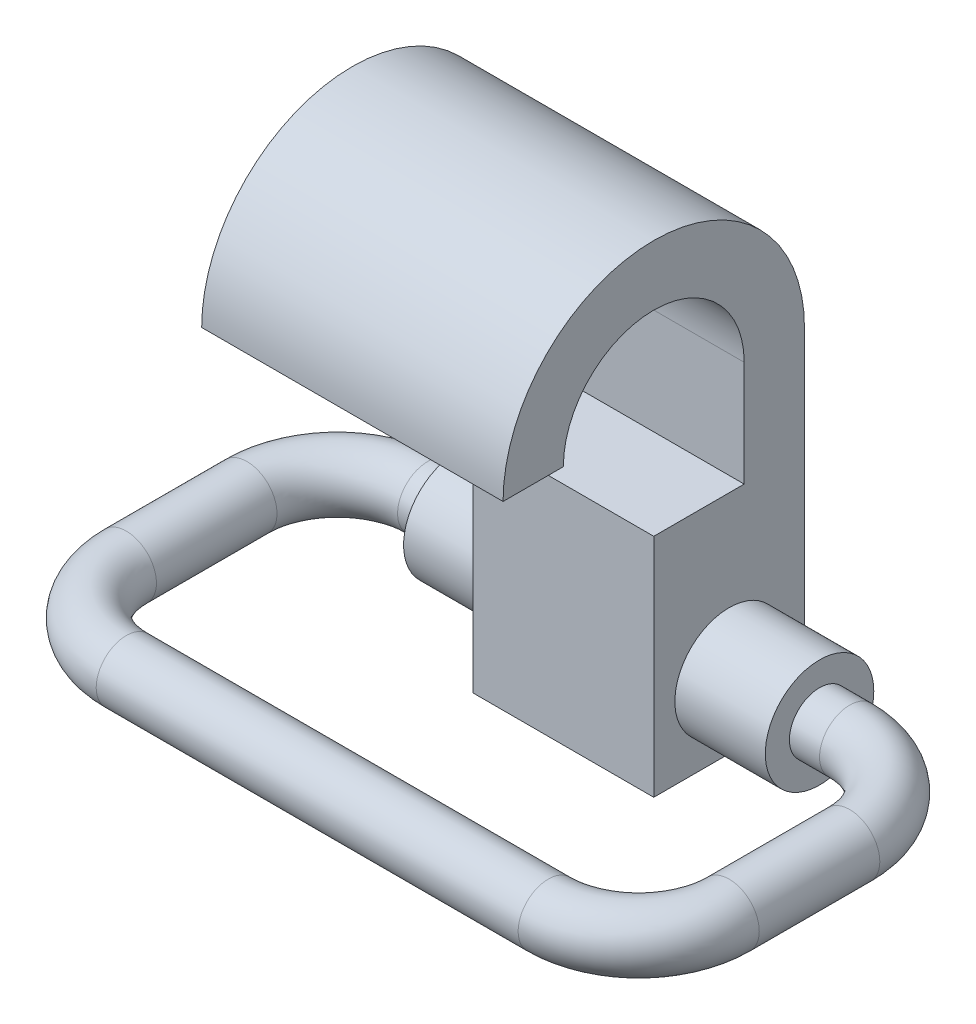
ISO-10303-21;
HEADER;
FILE_DESCRIPTION(('STEP AP214'),'2;1');
FILE_NAME('part.step','',(''),(''),'','','');
FILE_SCHEMA(('AUTOMOTIVE_DESIGN { 1 0 10303 214 1 1 1 1 }'));
ENDSEC;
DATA;
#1=APPLICATION_CONTEXT('core data for automotive mechanical design processes');
#2=APPLICATION_PROTOCOL_DEFINITION('international standard','automotive_design',2000,#1);
#3=PRODUCT_CONTEXT('',#1,'mechanical');
#4=PRODUCT('Part','Part','',(#3));
#5=PRODUCT_RELATED_PRODUCT_CATEGORY('part','',(#4));
#6=PRODUCT_DEFINITION_FORMATION('','',#4);
#7=PRODUCT_DEFINITION_CONTEXT('part definition',#1,'design');
#8=PRODUCT_DEFINITION('design','',#6,#7);
#9=PRODUCT_DEFINITION_SHAPE('','',#8);
#10=(LENGTH_UNIT() NAMED_UNIT(*) SI_UNIT(.MILLI.,.METRE.));
#11=(NAMED_UNIT(*) PLANE_ANGLE_UNIT() SI_UNIT($,.RADIAN.));
#12=(NAMED_UNIT(*) SI_UNIT($,.STERADIAN.) SOLID_ANGLE_UNIT());
#13=UNCERTAINTY_MEASURE_WITH_UNIT(LENGTH_MEASURE(1.E-05),#10,'distance_accuracy_value','');
#14=(GEOMETRIC_REPRESENTATION_CONTEXT(3) GLOBAL_UNCERTAINTY_ASSIGNED_CONTEXT((#13)) GLOBAL_UNIT_ASSIGNED_CONTEXT((#10,
#11,#12)) REPRESENTATION_CONTEXT('',''));
#15=CARTESIAN_POINT('',(0.,0.,0.));
#16=DIRECTION('',(0.,0.,1.));
#17=DIRECTION('',(1.,0.,0.));
#18=AXIS2_PLACEMENT_3D('',#15,#16,#17);
#19=CARTESIAN_POINT('',(-300.,725.,250.));
#20=DIRECTION('',(-1.,0.,0.));
#21=DIRECTION('',(0.,0.,-1.));
#22=AXIS2_PLACEMENT_3D('',#19,#20,#21);
#23=PLANE('',#22);
#24=CARTESIAN_POINT('',(-300.,-135.,0.));
#25=DIRECTION('',(1.,0.,0.));
#26=DIRECTION('',(0.,0.,-1.));
#27=AXIS2_PLACEMENT_3D('',#24,#25,#26);
#28=CIRCLE('',#27,180.);
#29=CARTESIAN_POINT('',(-300.,-135.,-180.));
#30=VERTEX_POINT('',#29);
#31=EDGE_CURVE('E41',#30,#30,#28,.F.);
#32=ORIENTED_EDGE('',*,*,#31,.F.);
#33=EDGE_LOOP('',(#32));
#34=FACE_BOUND('',#33,.T.);
#35=DIRECTION('',(0.,1.,0.));
#36=VECTOR('',#35,1.);
#37=CARTESIAN_POINT('',(-300.,724.999999999997,-50.));
#38=LINE('',#37,#36);
#39=CARTESIAN_POINT('',(-300.,375.,-50.));
#40=VERTEX_POINT('',#39);
#41=CARTESIAN_POINT('',(-300.,724.999999999997,-50.));
#42=VERTEX_POINT('',#41);
#43=EDGE_CURVE('E136',#40,#42,#38,.T.);
#44=ORIENTED_EDGE('',*,*,#43,.T.);
#45=DIRECTION('',(0.,0.,1.));
#46=VECTOR('',#45,1.);
#47=CARTESIAN_POINT('',(-300.,724.999999999997,-250.));
#48=LINE('',#47,#46);
#49=CARTESIAN_POINT('',(-300.,724.999999999997,-250.));
#50=VERTEX_POINT('',#49);
#51=EDGE_CURVE('E129',#50,#42,#48,.T.);
#52=ORIENTED_EDGE('',*,*,#51,.F.);
#53=DIRECTION('',(0.,-1.,0.));
#54=VECTOR('',#53,1.);
#55=CARTESIAN_POINT('',(-300.,375.,-250.));
#56=LINE('',#55,#54);
#57=CARTESIAN_POINT('',(-300.,-375.,-250.));
#58=VERTEX_POINT('',#57);
#59=EDGE_CURVE('E149',#50,#58,#56,.T.);
#60=ORIENTED_EDGE('',*,*,#59,.T.);
#61=DIRECTION('',(0.,0.,1.));
#62=VECTOR('',#61,1.);
#63=CARTESIAN_POINT('',(-300.,-375.,250.));
#64=LINE('',#63,#62);
#65=CARTESIAN_POINT('',(-300.,-375.,250.));
#66=VERTEX_POINT('',#65);
#67=EDGE_CURVE('E152',#58,#66,#64,.T.);
#68=ORIENTED_EDGE('',*,*,#67,.T.);
#69=DIRECTION('',(0.,1.,0.));
#70=VECTOR('',#69,1.);
#71=CARTESIAN_POINT('',(-300.,375.,250.));
#72=LINE('',#71,#70);
#73=CARTESIAN_POINT('',(-300.,375.,250.));
#74=VERTEX_POINT('',#73);
#75=EDGE_CURVE('E139',#66,#74,#72,.T.);
#76=ORIENTED_EDGE('',*,*,#75,.T.);
#77=DIRECTION('',(0.,0.,-1.));
#78=VECTOR('',#77,1.);
#79=CARTESIAN_POINT('',(-300.,375.,250.));
#80=LINE('',#79,#78);
#81=EDGE_CURVE('E146',#74,#40,#80,.T.);
#82=ORIENTED_EDGE('',*,*,#81,.T.);
#83=EDGE_LOOP('',(#44,#52,#60,#68,#76,#82));
#84=FACE_BOUND('',#83,.T.);
#85=ADVANCED_FACE('F37',(#34,#84),#23,.T.);
#86=CARTESIAN_POINT('',(300.,375.,0.));
#87=DIRECTION('',(0.,1.,0.));
#88=DIRECTION('',(0.,0.,1.));
#89=AXIS2_PLACEMENT_3D('',#86,#87,#88);
#90=PLANE('',#89);
#91=DIRECTION('',(1.,0.,0.));
#92=VECTOR('',#91,1.);
#93=CARTESIAN_POINT('',(0.,375.,-50.));
#94=LINE('',#93,#92);
#95=CARTESIAN_POINT('',(300.,375.,-50.));
#96=VERTEX_POINT('',#95);
#97=EDGE_CURVE('E192',#40,#96,#94,.T.);
#98=ORIENTED_EDGE('',*,*,#97,.F.);
#99=ORIENTED_EDGE('',*,*,#81,.F.);
#100=DIRECTION('',(-1.,0.,0.));
#101=VECTOR('',#100,1.);
#102=CARTESIAN_POINT('',(300.,375.,250.));
#103=LINE('',#102,#101);
#104=CARTESIAN_POINT('',(300.,375.,250.));
#105=VERTEX_POINT('',#104);
#106=EDGE_CURVE('E229',#105,#74,#103,.T.);
#107=ORIENTED_EDGE('',*,*,#106,.F.);
#108=DIRECTION('',(0.,0.,-1.));
#109=VECTOR('',#108,1.);
#110=CARTESIAN_POINT('',(300.,375.,0.));
#111=LINE('',#110,#109);
#112=EDGE_CURVE('E206',#105,#96,#111,.T.);
#113=ORIENTED_EDGE('',*,*,#112,.T.);
#114=EDGE_LOOP('',(#98,#99,#107,#113));
#115=FACE_BOUND('',#114,.T.);
#116=ADVANCED_FACE('F250',(#115),#90,.T.);
#117=CARTESIAN_POINT('',(-600.,-135.,0.));
#118=DIRECTION('',(1.,0.,0.));
#119=DIRECTION('',(0.,0.,-1.));
#120=AXIS2_PLACEMENT_3D('',#117,#118,#119);
#121=CYLINDRICAL_SURFACE('',#120,180.);
#122=CARTESIAN_POINT('',(-600.,-135.,0.));
#123=DIRECTION('',(1.,0.,0.));
#124=DIRECTION('',(0.,0.,-1.));
#125=AXIS2_PLACEMENT_3D('',#122,#123,#124);
#126=CIRCLE('',#125,180.);
#127=CARTESIAN_POINT('',(-600.,-135.,-180.));
#128=VERTEX_POINT('',#127);
#129=EDGE_CURVE('E155',#128,#128,#126,.T.);
#130=ORIENTED_EDGE('',*,*,#129,.T.);
#131=EDGE_LOOP('',(#130));
#132=FACE_BOUND('',#131,.T.);
#133=ORIENTED_EDGE('',*,*,#31,.T.);
#134=EDGE_LOOP('',(#133));
#135=FACE_BOUND('',#134,.T.);
#136=ADVANCED_FACE('F243',(#132,#135),#121,.T.);
#137=CARTESIAN_POINT('',(700.,-135.,0.));
#138=DIRECTION('',(-1.,0.,0.));
#139=DIRECTION('',(0.,0.,1.));
#140=AXIS2_PLACEMENT_3D('',#137,#138,#139);
#141=CYLINDRICAL_SURFACE('',#140,100.);
#142=CARTESIAN_POINT('',(600.,-135.,0.));
#143=DIRECTION('',(1.,0.,0.));
#144=DIRECTION('',(0.,0.,-1.));
#145=AXIS2_PLACEMENT_3D('',#142,#143,#144);
#146=CIRCLE('',#145,100.);
#147=CARTESIAN_POINT('',(600.,-135.,-100.));
#148=VERTEX_POINT('',#147);
#149=EDGE_CURVE('E231',#148,#148,#146,.T.);
#150=ORIENTED_EDGE('',*,*,#149,.T.);
#151=EDGE_LOOP('',(#150));
#152=FACE_BOUND('',#151,.T.);
#153=CARTESIAN_POINT('',(700.,-135.,0.));
#154=DIRECTION('',(1.,0.,0.));
#155=DIRECTION('',(0.,0.,-1.));
#156=AXIS2_PLACEMENT_3D('',#153,#154,#155);
#157=CIRCLE('',#156,100.);
#158=CARTESIAN_POINT('',(700.,-135.,-99.9999999999999));
#159=VERTEX_POINT('',#158);
#160=EDGE_CURVE('E46',#159,#159,#157,.T.);
#161=ORIENTED_EDGE('',*,*,#160,.F.);
#162=EDGE_LOOP('',(#161));
#163=FACE_BOUND('',#162,.T.);
#164=ADVANCED_FACE('F39',(#152,#163),#141,.T.);
#165=CARTESIAN_POINT('',(600.,-135.,0.));
#166=DIRECTION('',(-1.,0.,0.));
#167=DIRECTION('',(0.,0.,1.));
#168=AXIS2_PLACEMENT_3D('',#165,#166,#167);
#169=CYLINDRICAL_SURFACE('',#168,180.);
#170=CARTESIAN_POINT('',(300.,-135.,0.));
#171=DIRECTION('',(1.,0.,0.));
#172=DIRECTION('',(0.,0.,-1.));
#173=AXIS2_PLACEMENT_3D('',#170,#171,#172);
#174=CIRCLE('',#173,180.);
#175=CARTESIAN_POINT('',(300.,-135.,-180.));
#176=VERTEX_POINT('',#175);
#177=EDGE_CURVE('E200',#176,#176,#174,.T.);
#178=ORIENTED_EDGE('',*,*,#177,.T.);
#179=EDGE_LOOP('',(#178));
#180=FACE_BOUND('',#179,.T.);
#181=CARTESIAN_POINT('',(600.,-135.,0.));
#182=DIRECTION('',(1.,0.,0.));
#183=DIRECTION('',(0.,0.,-1.));
#184=AXIS2_PLACEMENT_3D('',#181,#182,#183);
#185=CIRCLE('',#184,180.);
#186=CARTESIAN_POINT('',(600.,-135.,-180.));
#187=VERTEX_POINT('',#186);
#188=EDGE_CURVE('E234',#187,#187,#185,.T.);
#189=ORIENTED_EDGE('',*,*,#188,.F.);
#190=EDGE_LOOP('',(#189));
#191=FACE_BOUND('',#190,.T.);
#192=ADVANCED_FACE('F242',(#180,#191),#169,.T.);
#193=CARTESIAN_POINT('',(600.,0.,0.));
#194=DIRECTION('',(1.,0.,0.));
#195=DIRECTION('',(0.,0.,-1.));
#196=AXIS2_PLACEMENT_3D('',#193,#194,#195);
#197=PLANE('',#196);
#198=ORIENTED_EDGE('',*,*,#149,.F.);
#199=EDGE_LOOP('',(#198));
#200=FACE_BOUND('',#199,.T.);
#201=ORIENTED_EDGE('',*,*,#188,.T.);
#202=EDGE_LOOP('',(#201));
#203=FACE_BOUND('',#202,.T.);
#204=ADVANCED_FACE('F249',(#200,#203),#197,.T.);
#205=CARTESIAN_POINT('',(300.,0.,250.));
#206=DIRECTION('',(0.,0.,1.));
#207=DIRECTION('',(0.,-1.,0.));
#208=AXIS2_PLACEMENT_3D('',#205,#206,#207);
#209=PLANE('',#208);
#210=ORIENTED_EDGE('',*,*,#106,.T.);
#211=ORIENTED_EDGE('',*,*,#75,.F.);
#212=DIRECTION('',(-1.,0.,0.));
#213=VECTOR('',#212,1.);
#214=CARTESIAN_POINT('',(300.,-375.,250.));
#215=LINE('',#214,#213);
#216=CARTESIAN_POINT('',(300.,-375.,250.));
#217=VERTEX_POINT('',#216);
#218=EDGE_CURVE('E61',#217,#66,#215,.T.);
#219=ORIENTED_EDGE('',*,*,#218,.F.);
#220=DIRECTION('',(0.,1.,0.));
#221=VECTOR('',#220,1.);
#222=CARTESIAN_POINT('',(300.,0.,250.));
#223=LINE('',#222,#221);
#224=EDGE_CURVE('E217',#217,#105,#223,.T.);
#225=ORIENTED_EDGE('',*,*,#224,.T.);
#226=EDGE_LOOP('',(#210,#211,#219,#225));
#227=FACE_BOUND('',#226,.T.);
#228=ADVANCED_FACE('F324',(#227),#209,.T.);
#229=CARTESIAN_POINT('',(300.,-375.,0.));
#230=DIRECTION('',(0.,1.,0.));
#231=DIRECTION('',(0.,0.,1.));
#232=AXIS2_PLACEMENT_3D('',#229,#230,#231);
#233=PLANE('',#232);
#234=ORIENTED_EDGE('',*,*,#218,.T.);
#235=ORIENTED_EDGE('',*,*,#67,.F.);
#236=DIRECTION('',(-1.,0.,0.));
#237=VECTOR('',#236,1.);
#238=CARTESIAN_POINT('',(300.,-375.,-250.));
#239=LINE('',#238,#237);
#240=CARTESIAN_POINT('',(300.,-375.,-250.));
#241=VERTEX_POINT('',#240);
#242=EDGE_CURVE('E226',#241,#58,#239,.T.);
#243=ORIENTED_EDGE('',*,*,#242,.F.);
#244=DIRECTION('',(0.,0.,-1.));
#245=VECTOR('',#244,1.);
#246=CARTESIAN_POINT('',(300.,-375.,0.));
#247=LINE('',#246,#245);
#248=EDGE_CURVE('E219',#217,#241,#247,.T.);
#249=ORIENTED_EDGE('',*,*,#248,.F.);
#250=EDGE_LOOP('',(#234,#235,#243,#249));
#251=FACE_BOUND('',#250,.T.);
#252=ADVANCED_FACE('F321',(#251),#233,.F.);
#253=CARTESIAN_POINT('',(300.,0.,-250.));
#254=DIRECTION('',(0.,0.,1.));
#255=DIRECTION('',(0.,-1.,0.));
#256=AXIS2_PLACEMENT_3D('',#253,#254,#255);
#257=PLANE('',#256);
#258=ORIENTED_EDGE('',*,*,#242,.T.);
#259=ORIENTED_EDGE('',*,*,#59,.F.);
#260=DIRECTION('',(-1.,0.,0.));
#261=VECTOR('',#260,1.);
#262=CARTESIAN_POINT('',(0.,725.,-250.));
#263=LINE('',#262,#261);
#264=CARTESIAN_POINT('',(300.,725.,-250.));
#265=VERTEX_POINT('',#264);
#266=EDGE_CURVE('E134',#265,#50,#263,.T.);
#267=ORIENTED_EDGE('',*,*,#266,.F.);
#268=DIRECTION('',(0.,1.,0.));
#269=VECTOR('',#268,1.);
#270=CARTESIAN_POINT('',(300.,0.,-250.));
#271=LINE('',#270,#269);
#272=EDGE_CURVE('E53',#241,#265,#271,.T.);
#273=ORIENTED_EDGE('',*,*,#272,.F.);
#274=EDGE_LOOP('',(#258,#259,#267,#273));
#275=FACE_BOUND('',#274,.T.);
#276=ADVANCED_FACE('F317',(#275),#257,.F.);
#277=CARTESIAN_POINT('',(300.,0.,0.));
#278=DIRECTION('',(1.,0.,0.));
#279=DIRECTION('',(0.,0.,-1.));
#280=AXIS2_PLACEMENT_3D('',#277,#278,#279);
#281=PLANE('',#280);
#282=ORIENTED_EDGE('',*,*,#177,.F.);
#283=EDGE_LOOP('',(#282));
#284=FACE_BOUND('',#283,.T.);
#285=ORIENTED_EDGE('',*,*,#112,.F.);
#286=ORIENTED_EDGE('',*,*,#224,.F.);
#287=ORIENTED_EDGE('',*,*,#248,.T.);
#288=ORIENTED_EDGE('',*,*,#272,.T.);
#289=CARTESIAN_POINT('',(300.,725.,250.));
#290=DIRECTION('',(1.,0.,0.));
#291=DIRECTION('',(0.,0.,-1.));
#292=AXIS2_PLACEMENT_3D('',#289,#290,#291);
#293=CIRCLE('',#292,500.);
#294=CARTESIAN_POINT('',(300.,725.,750.));
#295=VERTEX_POINT('',#294);
#296=EDGE_CURVE('E185',#265,#295,#293,.T.);
#297=ORIENTED_EDGE('',*,*,#296,.T.);
#298=DIRECTION('',(0.,0.,-1.));
#299=VECTOR('',#298,1.);
#300=CARTESIAN_POINT('',(300.,725.,750.));
#301=LINE('',#300,#299);
#302=CARTESIAN_POINT('',(300.,725.,550.));
#303=VERTEX_POINT('',#302);
#304=EDGE_CURVE('E182',#295,#303,#301,.T.);
#305=ORIENTED_EDGE('',*,*,#304,.T.);
#306=CARTESIAN_POINT('',(300.,725.,250.));
#307=DIRECTION('',(1.,0.,0.));
#308=DIRECTION('',(0.,0.,-1.));
#309=AXIS2_PLACEMENT_3D('',#306,#307,#308);
#310=CIRCLE('',#309,300.);
#311=CARTESIAN_POINT('',(300.,725.,-50.));
#312=VERTEX_POINT('',#311);
#313=EDGE_CURVE('E179',#312,#303,#310,.T.);
#314=ORIENTED_EDGE('',*,*,#313,.F.);
#315=DIRECTION('',(0.,-1.,0.));
#316=VECTOR('',#315,1.);
#317=CARTESIAN_POINT('',(300.,725.,-50.));
#318=LINE('',#317,#316);
#319=EDGE_CURVE('E197',#312,#96,#318,.T.);
#320=ORIENTED_EDGE('',*,*,#319,.T.);
#321=EDGE_LOOP('',(#285,#286,#287,#288,#297,#305,#314,#320));
#322=FACE_BOUND('',#321,.T.);
#323=ADVANCED_FACE('F313',(#284,#322),#281,.T.);
#324=CARTESIAN_POINT('',(0.,725.,-50.));
#325=DIRECTION('',(0.,0.,-1.));
#326=DIRECTION('',(-1.,0.,0.));
#327=AXIS2_PLACEMENT_3D('',#324,#325,#326);
#328=PLANE('',#327);
#329=ORIENTED_EDGE('',*,*,#97,.T.);
#330=ORIENTED_EDGE('',*,*,#319,.F.);
#331=DIRECTION('',(1.,0.,0.));
#332=VECTOR('',#331,1.);
#333=CARTESIAN_POINT('',(0.,725.,-50.));
#334=LINE('',#333,#332);
#335=EDGE_CURVE('E194',#42,#312,#334,.T.);
#336=ORIENTED_EDGE('',*,*,#335,.F.);
#337=ORIENTED_EDGE('',*,*,#43,.F.);
#338=EDGE_LOOP('',(#329,#330,#336,#337));
#339=FACE_BOUND('',#338,.T.);
#340=ADVANCED_FACE('F309',(#339),#328,.F.);
#341=CARTESIAN_POINT('',(0.,725.,250.));
#342=DIRECTION('',(1.,0.,0.));
#343=DIRECTION('',(0.,0.,-1.));
#344=AXIS2_PLACEMENT_3D('',#341,#342,#343);
#345=CYLINDRICAL_SURFACE('',#344,300.);
#346=ORIENTED_EDGE('',*,*,#313,.T.);
#347=DIRECTION('',(1.,0.,0.));
#348=VECTOR('',#347,1.);
#349=CARTESIAN_POINT('',(0.,725.,550.));
#350=LINE('',#349,#348);
#351=CARTESIAN_POINT('',(-700.,725.,550.));
#352=VERTEX_POINT('',#351);
#353=EDGE_CURVE('E190',#352,#303,#350,.T.);
#354=ORIENTED_EDGE('',*,*,#353,.F.);
#355=CARTESIAN_POINT('',(-700.,725.,250.));
#356=DIRECTION('',(1.,0.,0.));
#357=DIRECTION('',(0.,0.,1.));
#358=AXIS2_PLACEMENT_3D('',#355,#356,#357);
#359=CIRCLE('',#358,300.);
#360=CARTESIAN_POINT('',(-700.,724.999999999997,-50.));
#361=VERTEX_POINT('',#360);
#362=EDGE_CURVE('E120',#361,#352,#359,.T.);
#363=ORIENTED_EDGE('',*,*,#362,.F.);
#364=DIRECTION('',(1.,0.,0.));
#365=VECTOR('',#364,1.);
#366=CARTESIAN_POINT('',(-700.,724.999999999997,-50.));
#367=LINE('',#366,#365);
#368=EDGE_CURVE('E116',#361,#42,#367,.T.);
#369=ORIENTED_EDGE('',*,*,#368,.T.);
#370=ORIENTED_EDGE('',*,*,#335,.T.);
#371=EDGE_LOOP('',(#346,#354,#363,#369,#370));
#372=FACE_BOUND('',#371,.T.);
#373=ADVANCED_FACE('F305',(#372),#345,.F.);
#374=CARTESIAN_POINT('',(0.,725.,750.));
#375=DIRECTION('',(0.,-1.,0.));
#376=DIRECTION('',(0.,0.,-1.));
#377=AXIS2_PLACEMENT_3D('',#374,#375,#376);
#378=PLANE('',#377);
#379=ORIENTED_EDGE('',*,*,#304,.F.);
#380=DIRECTION('',(1.,0.,0.));
#381=VECTOR('',#380,1.);
#382=CARTESIAN_POINT('',(0.,725.,750.));
#383=LINE('',#382,#381);
#384=CARTESIAN_POINT('',(-700.,725.,750.));
#385=VERTEX_POINT('',#384);
#386=EDGE_CURVE('E188',#385,#295,#383,.T.);
#387=ORIENTED_EDGE('',*,*,#386,.F.);
#388=DIRECTION('',(0.,0.,1.));
#389=VECTOR('',#388,1.);
#390=CARTESIAN_POINT('',(-700.,725.,550.));
#391=LINE('',#390,#389);
#392=EDGE_CURVE('E127',#352,#385,#391,.T.);
#393=ORIENTED_EDGE('',*,*,#392,.F.);
#394=ORIENTED_EDGE('',*,*,#353,.T.);
#395=EDGE_LOOP('',(#379,#387,#393,#394));
#396=FACE_BOUND('',#395,.T.);
#397=ADVANCED_FACE('F302',(#396),#378,.T.);
#398=CARTESIAN_POINT('',(0.,725.,250.));
#399=DIRECTION('',(1.,0.,0.));
#400=DIRECTION('',(0.,0.,-1.));
#401=AXIS2_PLACEMENT_3D('',#398,#399,#400);
#402=CYLINDRICAL_SURFACE('',#401,500.);
#403=ORIENTED_EDGE('',*,*,#296,.F.);
#404=ORIENTED_EDGE('',*,*,#266,.T.);
#405=DIRECTION('',(1.,0.,0.));
#406=VECTOR('',#405,1.);
#407=CARTESIAN_POINT('',(-700.,724.999999999997,-250.));
#408=LINE('',#407,#406);
#409=CARTESIAN_POINT('',(-700.,724.999999999997,-250.));
#410=VERTEX_POINT('',#409);
#411=EDGE_CURVE('E113',#410,#50,#408,.T.);
#412=ORIENTED_EDGE('',*,*,#411,.F.);
#413=CARTESIAN_POINT('',(-700.,725.,250.));
#414=DIRECTION('',(-1.,0.,0.));
#415=DIRECTION('',(0.,0.,1.));
#416=AXIS2_PLACEMENT_3D('',#413,#414,#415);
#417=CIRCLE('',#416,500.);
#418=EDGE_CURVE('E121',#385,#410,#417,.T.);
#419=ORIENTED_EDGE('',*,*,#418,.F.);
#420=ORIENTED_EDGE('',*,*,#386,.T.);
#421=EDGE_LOOP('',(#403,#404,#412,#419,#420));
#422=FACE_BOUND('',#421,.T.);
#423=ADVANCED_FACE('F133',(#422),#402,.T.);
#424=CARTESIAN_POINT('',(700.,-135.,300.));
#425=DIRECTION('',(0.,1.,0.));
#426=DIRECTION('',(0.,0.,1.));
#427=AXIS2_PLACEMENT_3D('',#424,#425,#426);
#428=TOROIDAL_SURFACE('',#427,300.,100.);
#429=CARTESIAN_POINT('',(1000.,-135.,300.));
#430=DIRECTION('',(0.,0.,1.));
#431=DIRECTION('',(1.,0.,0.));
#432=AXIS2_PLACEMENT_3D('',#429,#430,#431);
#433=CIRCLE('',#432,100.);
#434=CARTESIAN_POINT('',(1100.,-135.,300.));
#435=VERTEX_POINT('',#434);
#436=EDGE_CURVE('E176',#435,#435,#433,.T.);
#437=CARTESIAN_POINT('',(700.,-135.,300.));
#438=DIRECTION('',(0.,1.,0.));
#439=DIRECTION('',(0.,0.,1.));
#440=AXIS2_PLACEMENT_3D('',#437,#438,#439);
#441=CIRCLE('',#440,400.);
#442=EDGE_CURVE('',#435,#159,#441,.T.);
#443=ORIENTED_EDGE('',*,*,#436,.F.);
#444=ORIENTED_EDGE('',*,*,#160,.T.);
#445=ORIENTED_EDGE('',*,*,#442,.T.);
#446=ORIENTED_EDGE('',*,*,#442,.F.);
#447=EDGE_LOOP('',(#443,#445,#444,#446));
#448=FACE_BOUND('',#447,.T.);
#449=ADVANCED_FACE('F239',(#448),#428,.T.);
#450=CARTESIAN_POINT('',(1000.,-135.,700.));
#451=DIRECTION('',(0.,0.,-1.));
#452=DIRECTION('',(-1.,0.,0.));
#453=AXIS2_PLACEMENT_3D('',#450,#451,#452);
#454=CYLINDRICAL_SURFACE('',#453,100.);
#455=CARTESIAN_POINT('',(1000.,-135.,700.));
#456=DIRECTION('',(0.,0.,1.));
#457=DIRECTION('',(1.,0.,0.));
#458=AXIS2_PLACEMENT_3D('',#455,#456,#457);
#459=CIRCLE('',#458,100.);
#460=CARTESIAN_POINT('',(1100.,-135.,700.));
#461=VERTEX_POINT('',#460);
#462=EDGE_CURVE('E173',#461,#461,#459,.T.);
#463=ORIENTED_EDGE('',*,*,#462,.F.);
#464=EDGE_LOOP('',(#463));
#465=FACE_BOUND('',#464,.T.);
#466=ORIENTED_EDGE('',*,*,#436,.T.);
#467=EDGE_LOOP('',(#466));
#468=FACE_BOUND('',#467,.T.);
#469=ADVANCED_FACE('F292',(#465,#468),#454,.T.);
#470=CARTESIAN_POINT('',(700.,-135.,700.));
#471=DIRECTION('',(0.,1.,0.));
#472=DIRECTION('',(0.,0.,1.));
#473=AXIS2_PLACEMENT_3D('',#470,#471,#472);
#474=TOROIDAL_SURFACE('',#473,300.,100.);
#475=CARTESIAN_POINT('',(700.,-135.,1000.));
#476=DIRECTION('',(-1.,0.,0.));
#477=DIRECTION('',(0.,0.,1.));
#478=AXIS2_PLACEMENT_3D('',#475,#476,#477);
#479=CIRCLE('',#478,100.);
#480=CARTESIAN_POINT('',(700.,-135.,1100.));
#481=VERTEX_POINT('',#480);
#482=EDGE_CURVE('E170',#481,#481,#479,.T.);
#483=CARTESIAN_POINT('',(700.,-135.,700.));
#484=DIRECTION('',(0.,1.,0.));
#485=DIRECTION('',(0.,0.,1.));
#486=AXIS2_PLACEMENT_3D('',#483,#484,#485);
#487=CIRCLE('',#486,400.);
#488=EDGE_CURVE('',#481,#461,#487,.T.);
#489=ORIENTED_EDGE('',*,*,#482,.F.);
#490=ORIENTED_EDGE('',*,*,#462,.T.);
#491=ORIENTED_EDGE('',*,*,#488,.T.);
#492=ORIENTED_EDGE('',*,*,#488,.F.);
#493=EDGE_LOOP('',(#489,#491,#490,#492));
#494=FACE_BOUND('',#493,.T.);
#495=ADVANCED_FACE('F288',(#494),#474,.T.);
#496=CARTESIAN_POINT('',(-1.11022302462516E-13,-135.,1000.));
#497=DIRECTION('',(1.,0.,0.));
#498=DIRECTION('',(0.,1.,0.));
#499=AXIS2_PLACEMENT_3D('',#496,#497,#498);
#500=CYLINDRICAL_SURFACE('',#499,100.);
#501=ORIENTED_EDGE('',*,*,#482,.T.);
#502=EDGE_LOOP('',(#501));
#503=FACE_BOUND('',#502,.T.);
#504=CARTESIAN_POINT('',(-700.,-135.,1000.));
#505=DIRECTION('',(-1.,0.,0.));
#506=DIRECTION('',(0.,-1.,0.));
#507=AXIS2_PLACEMENT_3D('',#504,#505,#506);
#508=CIRCLE('',#507,100.);
#509=CARTESIAN_POINT('',(-700.,-135.,1100.));
#510=VERTEX_POINT('',#509);
#511=EDGE_CURVE('E167',#510,#510,#508,.T.);
#512=ORIENTED_EDGE('',*,*,#511,.F.);
#513=EDGE_LOOP('',(#512));
#514=FACE_BOUND('',#513,.T.);
#515=ADVANCED_FACE('F284',(#503,#514),#500,.T.);
#516=CARTESIAN_POINT('',(-700.,-135.,700.));
#517=DIRECTION('',(0.,-1.,0.));
#518=DIRECTION('',(0.,0.,-1.));
#519=AXIS2_PLACEMENT_3D('',#516,#517,#518);
#520=TOROIDAL_SURFACE('',#519,300.,100.);
#521=CARTESIAN_POINT('',(-1000.,-135.,700.));
#522=DIRECTION('',(0.,0.,-1.));
#523=DIRECTION('',(-1.,0.,0.));
#524=AXIS2_PLACEMENT_3D('',#521,#522,#523);
#525=CIRCLE('',#524,100.);
#526=CARTESIAN_POINT('',(-1100.,-135.,700.));
#527=VERTEX_POINT('',#526);
#528=EDGE_CURVE('E164',#527,#527,#525,.T.);
#529=CARTESIAN_POINT('',(-700.,-135.,700.));
#530=DIRECTION('',(0.,-1.,0.));
#531=DIRECTION('',(0.,0.,-1.));
#532=AXIS2_PLACEMENT_3D('',#529,#530,#531);
#533=CIRCLE('',#532,400.);
#534=EDGE_CURVE('',#510,#527,#533,.T.);
#535=ORIENTED_EDGE('',*,*,#511,.T.);
#536=ORIENTED_EDGE('',*,*,#528,.F.);
#537=ORIENTED_EDGE('',*,*,#534,.T.);
#538=ORIENTED_EDGE('',*,*,#534,.F.);
#539=EDGE_LOOP('',(#535,#537,#536,#538));
#540=FACE_BOUND('',#539,.T.);
#541=ADVANCED_FACE('F280',(#540),#520,.T.);
#542=CARTESIAN_POINT('',(-1000.,-135.,700.));
#543=DIRECTION('',(0.,0.,-1.));
#544=DIRECTION('',(-1.,0.,0.));
#545=AXIS2_PLACEMENT_3D('',#542,#543,#544);
#546=CYLINDRICAL_SURFACE('',#545,100.);
#547=ORIENTED_EDGE('',*,*,#528,.T.);
#548=EDGE_LOOP('',(#547));
#549=FACE_BOUND('',#548,.T.);
#550=CARTESIAN_POINT('',(-1000.,-135.,300.));
#551=DIRECTION('',(0.,0.,-1.));
#552=DIRECTION('',(-1.,0.,0.));
#553=AXIS2_PLACEMENT_3D('',#550,#551,#552);
#554=CIRCLE('',#553,100.);
#555=CARTESIAN_POINT('',(-1100.,-135.,300.));
#556=VERTEX_POINT('',#555);
#557=EDGE_CURVE('E161',#556,#556,#554,.T.);
#558=ORIENTED_EDGE('',*,*,#557,.F.);
#559=EDGE_LOOP('',(#558));
#560=FACE_BOUND('',#559,.T.);
#561=ADVANCED_FACE('F276',(#549,#560),#546,.T.);
#562=CARTESIAN_POINT('',(-700.,-135.,300.));
#563=DIRECTION('',(0.,-1.,0.));
#564=DIRECTION('',(0.,0.,-1.));
#565=AXIS2_PLACEMENT_3D('',#562,#563,#564);
#566=TOROIDAL_SURFACE('',#565,300.,100.);
#567=CARTESIAN_POINT('',(-700.,-135.,0.));
#568=DIRECTION('',(1.,0.,0.));
#569=DIRECTION('',(0.,0.,-1.));
#570=AXIS2_PLACEMENT_3D('',#567,#568,#569);
#571=CIRCLE('',#570,100.);
#572=CARTESIAN_POINT('',(-700.,-135.,-99.9999999999999));
#573=VERTEX_POINT('',#572);
#574=EDGE_CURVE('E158',#573,#573,#571,.T.);
#575=CARTESIAN_POINT('',(-700.,-135.,300.));
#576=DIRECTION('',(0.,-1.,0.));
#577=DIRECTION('',(0.,0.,-1.));
#578=AXIS2_PLACEMENT_3D('',#575,#576,#577);
#579=CIRCLE('',#578,400.);
#580=EDGE_CURVE('',#556,#573,#579,.T.);
#581=ORIENTED_EDGE('',*,*,#557,.T.);
#582=ORIENTED_EDGE('',*,*,#574,.F.);
#583=ORIENTED_EDGE('',*,*,#580,.T.);
#584=ORIENTED_EDGE('',*,*,#580,.F.);
#585=EDGE_LOOP('',(#581,#583,#582,#584));
#586=FACE_BOUND('',#585,.T.);
#587=ADVANCED_FACE('F272',(#586),#566,.T.);
#588=CARTESIAN_POINT('',(-700.,-135.,0.));
#589=DIRECTION('',(1.,0.,0.));
#590=DIRECTION('',(0.,0.,-1.));
#591=AXIS2_PLACEMENT_3D('',#588,#589,#590);
#592=CYLINDRICAL_SURFACE('',#591,100.);
#593=CARTESIAN_POINT('',(-600.,-135.,0.));
#594=DIRECTION('',(-1.,0.,0.));
#595=DIRECTION('',(0.,0.,1.));
#596=AXIS2_PLACEMENT_3D('',#593,#594,#595);
#597=CIRCLE('',#596,100.);
#598=CARTESIAN_POINT('',(-600.,-135.,100.));
#599=VERTEX_POINT('',#598);
#600=EDGE_CURVE('E11',#599,#599,#597,.F.);
#601=ORIENTED_EDGE('',*,*,#600,.F.);
#602=EDGE_LOOP('',(#601));
#603=FACE_BOUND('',#602,.T.);
#604=ORIENTED_EDGE('',*,*,#574,.T.);
#605=EDGE_LOOP('',(#604));
#606=FACE_BOUND('',#605,.T.);
#607=ADVANCED_FACE('F267',(#603,#606),#592,.T.);
#608=CARTESIAN_POINT('',(-600.,0.,0.));
#609=DIRECTION('',(-1.,0.,0.));
#610=DIRECTION('',(0.,0.,-1.));
#611=AXIS2_PLACEMENT_3D('',#608,#609,#610);
#612=PLANE('',#611);
#613=ORIENTED_EDGE('',*,*,#600,.T.);
#614=EDGE_LOOP('',(#613));
#615=FACE_BOUND('',#614,.T.);
#616=ORIENTED_EDGE('',*,*,#129,.F.);
#617=EDGE_LOOP('',(#616));
#618=FACE_BOUND('',#617,.T.);
#619=ADVANCED_FACE('F265',(#615,#618),#612,.T.);
#620=CARTESIAN_POINT('',(-700.,724.999999999997,-250.));
#621=DIRECTION('',(0.,1.,0.));
#622=DIRECTION('',(0.,0.,1.));
#623=AXIS2_PLACEMENT_3D('',#620,#621,#622);
#624=PLANE('',#623);
#625=ORIENTED_EDGE('',*,*,#51,.T.);
#626=ORIENTED_EDGE('',*,*,#368,.F.);
#627=DIRECTION('',(0.,0.,1.));
#628=VECTOR('',#627,1.);
#629=CARTESIAN_POINT('',(-700.,724.999999999997,-250.));
#630=LINE('',#629,#628);
#631=EDGE_CURVE('E109',#410,#361,#630,.T.);
#632=ORIENTED_EDGE('',*,*,#631,.F.);
#633=ORIENTED_EDGE('',*,*,#411,.T.);
#634=EDGE_LOOP('',(#625,#626,#632,#633));
#635=FACE_BOUND('',#634,.T.);
#636=ADVANCED_FACE('F111',(#635),#624,.F.);
#637=CARTESIAN_POINT('',(-700.,725.,250.));
#638=DIRECTION('',(-1.,0.,0.));
#639=DIRECTION('',(0.,0.,1.));
#640=AXIS2_PLACEMENT_3D('',#637,#638,#639);
#641=PLANE('',#640);
#642=ORIENTED_EDGE('',*,*,#418,.T.);
#643=ORIENTED_EDGE('',*,*,#631,.T.);
#644=ORIENTED_EDGE('',*,*,#362,.T.);
#645=ORIENTED_EDGE('',*,*,#392,.T.);
#646=EDGE_LOOP('',(#642,#643,#644,#645));
#647=FACE_BOUND('',#646,.T.);
#648=ADVANCED_FACE('F125',(#647),#641,.T.);
#649=CLOSED_SHELL('',(#85,#116,#136,#164,#192,#204,#228,#252,#276,#323,#340,#373,#397,#423,#449,
#469,#495,#515,#541,#561,#587,#607,#619,#636,#648));
#650=MANIFOLD_SOLID_BREP('B2',#649);
#651=ADVANCED_BREP_SHAPE_REPRESENTATION('',(#18,#650),#14);
#652=SHAPE_DEFINITION_REPRESENTATION(#9,#651);
ENDSEC;
END-ISO-10303-21;
